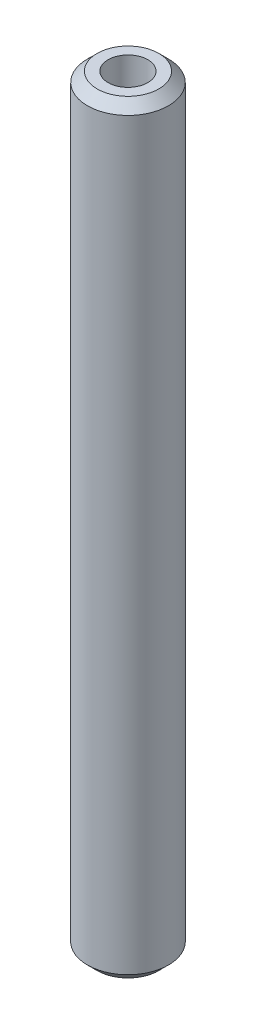
ISO-10303-21;
HEADER;
FILE_DESCRIPTION(('STEP AP214'),'2;1');
FILE_NAME('part.step','',(''),(''),'','','');
FILE_SCHEMA(('AUTOMOTIVE_DESIGN { 1 0 10303 214 1 1 1 1 }'));
ENDSEC;
DATA;
#1=APPLICATION_CONTEXT('core data for automotive mechanical design processes');
#2=APPLICATION_PROTOCOL_DEFINITION('international standard','automotive_design',2000,#1);
#3=PRODUCT_CONTEXT('',#1,'mechanical');
#4=PRODUCT('Part','Part','',(#3));
#5=PRODUCT_RELATED_PRODUCT_CATEGORY('part','',(#4));
#6=PRODUCT_DEFINITION_FORMATION('','',#4);
#7=PRODUCT_DEFINITION_CONTEXT('part definition',#1,'design');
#8=PRODUCT_DEFINITION('design','',#6,#7);
#9=PRODUCT_DEFINITION_SHAPE('','',#8);
#10=(LENGTH_UNIT() NAMED_UNIT(*) SI_UNIT(.MILLI.,.METRE.));
#11=(NAMED_UNIT(*) PLANE_ANGLE_UNIT() SI_UNIT($,.RADIAN.));
#12=(NAMED_UNIT(*) SI_UNIT($,.STERADIAN.) SOLID_ANGLE_UNIT());
#13=UNCERTAINTY_MEASURE_WITH_UNIT(LENGTH_MEASURE(1.E-05),#10,'distance_accuracy_value','');
#14=(GEOMETRIC_REPRESENTATION_CONTEXT(3) GLOBAL_UNCERTAINTY_ASSIGNED_CONTEXT((#13)) GLOBAL_UNIT_ASSIGNED_CONTEXT((#10,
#11,#12)) REPRESENTATION_CONTEXT('',''));
#15=CARTESIAN_POINT('',(0.,0.,0.));
#16=DIRECTION('',(0.,0.,1.));
#17=DIRECTION('',(1.,0.,0.));
#18=AXIS2_PLACEMENT_3D('',#15,#16,#17);
#19=CARTESIAN_POINT('',(0.,94.2059871380384,0.));
#20=DIRECTION('',(0.,-1.,0.));
#21=DIRECTION('',(0.,0.,-1.));
#22=AXIS2_PLACEMENT_3D('',#19,#20,#21);
#23=CYLINDRICAL_SURFACE('',#22,5.);
#24=CARTESIAN_POINT('',(0.,93.0087555606454,0.));
#25=DIRECTION('',(0.,1.,0.));
#26=DIRECTION('',(0.,0.,1.));
#27=AXIS2_PLACEMENT_3D('',#24,#25,#26);
#28=CIRCLE('',#27,5.);
#29=CARTESIAN_POINT('',(0.,93.0087555606454,5.));
#30=VERTEX_POINT('',#29);
#31=EDGE_CURVE('E50',#30,#30,#28,.F.);
#32=ORIENTED_EDGE('',*,*,#31,.T.);
#33=EDGE_LOOP('',(#32));
#34=FACE_BOUND('',#33,.T.);
#35=CARTESIAN_POINT('',(0.,1.197231577393,0.));
#36=DIRECTION('',(0.,1.,0.));
#37=DIRECTION('',(0.,0.,1.));
#38=AXIS2_PLACEMENT_3D('',#35,#36,#37);
#39=CIRCLE('',#38,5.);
#40=CARTESIAN_POINT('',(0.,1.197231577393,5.));
#41=VERTEX_POINT('',#40);
#42=EDGE_CURVE('E51',#41,#41,#39,.T.);
#43=ORIENTED_EDGE('',*,*,#42,.T.);
#44=EDGE_LOOP('',(#43));
#45=FACE_BOUND('',#44,.T.);
#46=ADVANCED_FACE('F39',(#34,#45),#23,.T.);
#47=CARTESIAN_POINT('',(0.,94.2059871380384,0.));
#48=DIRECTION('',(0.,1.,0.));
#49=DIRECTION('',(0.,0.,1.));
#50=AXIS2_PLACEMENT_3D('',#47,#48,#49);
#51=PLANE('',#50);
#52=CARTESIAN_POINT('',(0.,94.2059871380384,0.));
#53=DIRECTION('',(0.,1.,0.));
#54=DIRECTION('',(0.,0.,1.));
#55=AXIS2_PLACEMENT_3D('',#52,#53,#54);
#56=CIRCLE('',#55,3.80276842260699);
#57=CARTESIAN_POINT('',(0.,94.2059871380384,3.80276842260699));
#58=VERTEX_POINT('',#57);
#59=EDGE_CURVE('E54',#58,#58,#56,.T.);
#60=ORIENTED_EDGE('',*,*,#59,.T.);
#61=EDGE_LOOP('',(#60));
#62=FACE_BOUND('',#61,.T.);
#63=CARTESIAN_POINT('',(0.,94.2059871380384,0.));
#64=DIRECTION('',(0.,1.,0.));
#65=DIRECTION('',(0.,0.,1.));
#66=AXIS2_PLACEMENT_3D('',#63,#64,#65);
#67=CIRCLE('',#66,2.45373357901315);
#68=CARTESIAN_POINT('',(0.,94.2059871380384,2.45373357901315));
#69=VERTEX_POINT('',#68);
#70=EDGE_CURVE('E58',#69,#69,#67,.T.);
#71=ORIENTED_EDGE('',*,*,#70,.F.);
#72=EDGE_LOOP('',(#71));
#73=FACE_BOUND('',#72,.T.);
#74=ADVANCED_FACE('F69',(#62,#73),#51,.T.);
#75=CARTESIAN_POINT('',(0.,0.,0.));
#76=DIRECTION('',(0.,1.,0.));
#77=DIRECTION('',(0.,0.,1.));
#78=AXIS2_PLACEMENT_3D('',#75,#76,#77);
#79=PLANE('',#78);
#80=CARTESIAN_POINT('',(0.,0.,0.));
#81=DIRECTION('',(0.,1.,0.));
#82=DIRECTION('',(0.,0.,1.));
#83=AXIS2_PLACEMENT_3D('',#80,#81,#82);
#84=CIRCLE('',#83,3.80276842260698);
#85=CARTESIAN_POINT('',(0.,0.,3.80276842260697));
#86=VERTEX_POINT('',#85);
#87=EDGE_CURVE('E10',#86,#86,#84,.F.);
#88=ORIENTED_EDGE('',*,*,#87,.T.);
#89=EDGE_LOOP('',(#88));
#90=FACE_BOUND('',#89,.T.);
#91=CARTESIAN_POINT('',(0.,0.,0.));
#92=DIRECTION('',(0.,1.,0.));
#93=DIRECTION('',(0.,0.,1.));
#94=AXIS2_PLACEMENT_3D('',#91,#92,#93);
#95=CIRCLE('',#94,2.45373357901315);
#96=CARTESIAN_POINT('',(0.,0.,2.45373357901315));
#97=VERTEX_POINT('',#96);
#98=EDGE_CURVE('E63',#97,#97,#95,.T.);
#99=ORIENTED_EDGE('',*,*,#98,.T.);
#100=EDGE_LOOP('',(#99));
#101=FACE_BOUND('',#100,.T.);
#102=ADVANCED_FACE('F75',(#90,#101),#79,.F.);
#103=CARTESIAN_POINT('',(0.,94.2059871380384,0.));
#104=DIRECTION('',(0.,-1.,0.));
#105=DIRECTION('',(0.,0.,-1.));
#106=AXIS2_PLACEMENT_3D('',#103,#104,#105);
#107=CYLINDRICAL_SURFACE('',#106,2.45373357901315);
#108=ORIENTED_EDGE('',*,*,#70,.T.);
#109=EDGE_LOOP('',(#108));
#110=FACE_BOUND('',#109,.T.);
#111=ORIENTED_EDGE('',*,*,#98,.F.);
#112=EDGE_LOOP('',(#111));
#113=FACE_BOUND('',#112,.T.);
#114=ADVANCED_FACE('F70',(#110,#113),#107,.F.);
#115=CARTESIAN_POINT('',(0.,94.2059871380384,0.));
#116=DIRECTION('',(0.,-1.,0.));
#117=DIRECTION('',(0.,0.,-1.));
#118=AXIS2_PLACEMENT_3D('',#115,#116,#117);
#119=CONICAL_SURFACE('',#118,3.80276842260699,0.785398163397447);
#120=ORIENTED_EDGE('',*,*,#31,.F.);
#121=EDGE_LOOP('',(#120));
#122=FACE_BOUND('',#121,.T.);
#123=ORIENTED_EDGE('',*,*,#59,.F.);
#124=EDGE_LOOP('',(#123));
#125=FACE_BOUND('',#124,.T.);
#126=ADVANCED_FACE('F81',(#122,#125),#119,.T.);
#127=CARTESIAN_POINT('',(0.,1.197231577393,0.));
#128=DIRECTION('',(0.,1.,0.));
#129=DIRECTION('',(0.,0.,1.));
#130=AXIS2_PLACEMENT_3D('',#127,#128,#129);
#131=CONICAL_SURFACE('',#130,5.,0.785398163397458);
#132=CARTESIAN_POINT('',(0.,0.,3.80276842260697));
#133=CARTESIAN_POINT('',(0.,0.0124711622645101,3.81523958487149));
#134=CARTESIAN_POINT('',(0.,0.0249423245290205,3.827710747136));
#135=CARTESIAN_POINT('',(0.,0.0498846490580415,3.85265307166502));
#136=CARTESIAN_POINT('',(0.,0.062355811322552,3.86512423392953));
#137=CARTESIAN_POINT('',(0.,0.0872981358515729,3.89006655845855));
#138=CARTESIAN_POINT('',(0.,0.0997692981160832,3.90253772072306));
#139=CARTESIAN_POINT('',(0.,0.124711622645104,3.92748004525208));
#140=CARTESIAN_POINT('',(0.,0.137182784909614,3.93995120751659));
#141=CARTESIAN_POINT('',(0.,0.162125109438635,3.96489353204561));
#142=CARTESIAN_POINT('',(0.,0.174596271703146,3.97736469431012));
#143=CARTESIAN_POINT('',(0.,0.199538596232167,4.00230701883915));
#144=CARTESIAN_POINT('',(0.,0.212009758496677,4.01477818110366));
#145=CARTESIAN_POINT('',(0.,0.236952083025698,4.03972050563268));
#146=CARTESIAN_POINT('',(0.,0.249423245290208,4.05219166789719));
#147=CARTESIAN_POINT('',(0.,0.274365569819229,4.07713399242621));
#148=CARTESIAN_POINT('',(0.,0.28683673208374,4.08960515469072));
#149=CARTESIAN_POINT('',(0.,0.311779056612761,4.11454747921974));
#150=CARTESIAN_POINT('',(0.,0.324250218877271,4.12701864148425));
#151=CARTESIAN_POINT('',(0.,0.349192543406292,4.15196096601327));
#152=CARTESIAN_POINT('',(0.,0.361663705670802,4.16443212827778));
#153=CARTESIAN_POINT('',(0.,0.386606030199823,4.18937445280681));
#154=CARTESIAN_POINT('',(0.,0.399077192464334,4.20184561507132));
#155=CARTESIAN_POINT('',(0.,0.424019516993355,4.22678793960034));
#156=CARTESIAN_POINT('',(0.,0.436490679257865,4.23925910186485));
#157=CARTESIAN_POINT('',(0.,0.461433003786886,4.26420142639387));
#158=CARTESIAN_POINT('',(0.,0.473904166051396,4.27667258865838));
#159=CARTESIAN_POINT('',(0.,0.498846490580417,4.3016149131874));
#160=CARTESIAN_POINT('',(0.,0.511317652844928,4.31408607545191));
#161=CARTESIAN_POINT('',(0.,0.536259977373948,4.33902839998093));
#162=CARTESIAN_POINT('',(0.,0.548731139638459,4.35149956224544));
#163=CARTESIAN_POINT('',(0.,0.57367346416748,4.37644188677447));
#164=CARTESIAN_POINT('',(0.,0.58614462643199,4.38891304903898));
#165=CARTESIAN_POINT('',(0.,0.611086950961011,4.413855373568));
#166=CARTESIAN_POINT('',(0.,0.623558113225521,4.42632653583251));
#167=CARTESIAN_POINT('',(0.,0.648500437754542,4.45126886036153));
#168=CARTESIAN_POINT('',(0.,0.660971600019053,4.46374002262604));
#169=CARTESIAN_POINT('',(0.,0.685913924548074,4.48868234715506));
#170=CARTESIAN_POINT('',(0.,0.698385086812584,4.50115350941957));
#171=CARTESIAN_POINT('',(0.,0.723327411341605,4.52609583394859));
#172=CARTESIAN_POINT('',(0.,0.735798573606115,4.53856699621311));
#173=CARTESIAN_POINT('',(0.,0.760740898135136,4.56350932074213));
#174=CARTESIAN_POINT('',(0.,0.773212060399647,4.57598048300664));
#175=CARTESIAN_POINT('',(0.,0.798154384928668,4.60092280753566));
#176=CARTESIAN_POINT('',(0.,0.810625547193178,4.61339396980017));
#177=CARTESIAN_POINT('',(0.,0.835567871722199,4.63833629432919));
#178=CARTESIAN_POINT('',(0.,0.848039033986709,4.6508074565937));
#179=CARTESIAN_POINT('',(0.,0.87298135851573,4.67574978112272));
#180=CARTESIAN_POINT('',(0.,0.885452520780241,4.68822094338723));
#181=CARTESIAN_POINT('',(0.,0.910394845309262,4.71316326791625));
#182=CARTESIAN_POINT('',(0.,0.922866007573772,4.72563443018077));
#183=CARTESIAN_POINT('',(0.,0.947808332102793,4.75057675470979));
#184=CARTESIAN_POINT('',(0.,0.960279494367303,4.7630479169743));
#185=CARTESIAN_POINT('',(0.,0.985221818896324,4.78799024150332));
#186=CARTESIAN_POINT('',(0.,0.997692981160835,4.80046140376783));
#187=CARTESIAN_POINT('',(0.,1.02263530568986,4.82540372829685));
#188=CARTESIAN_POINT('',(0.,1.03510646795437,4.83787489056136));
#189=CARTESIAN_POINT('',(0.,1.06004879248339,4.86281721509038));
#190=CARTESIAN_POINT('',(0.,1.0725199547479,4.87528837735489));
#191=CARTESIAN_POINT('',(0.,1.09746227927692,4.90023070188392));
#192=CARTESIAN_POINT('',(0.,1.10993344154143,4.91270186414843));
#193=CARTESIAN_POINT('',(0.,1.13487576607045,4.93764418867745));
#194=CARTESIAN_POINT('',(0.,1.14734692833496,4.95011535094196));
#195=CARTESIAN_POINT('',(0.,1.17228925286398,4.97505767547098));
#196=CARTESIAN_POINT('',(0.,1.18476041512849,4.98752883773549));
#197=CARTESIAN_POINT('',(0.,1.197231577393,5.));
#198=B_SPLINE_CURVE_WITH_KNOTS('',3,(#132,#133,#134,#135,#136,#137,#138,#139,#140,#141,#142,
#143,#144,#145,#146,#147,#148,#149,#150,#151,#152,#153,#154,#155,#156,#157,#158,#159,#160,#161,
#162,#163,#164,#165,#166,#167,#168,#169,#170,#171,#172,#173,#174,#175,#176,#177,#178,#179,#180,
#181,#182,#183,#184,#185,#186,#187,#188,#189,#190,#191,#192,#193,#194,#195,#196,#197),
.UNSPECIFIED.,.F.,.F.,(4,2,2,2,2,2,2,2,2,2,2,2,2,2,2,2,2,2,2,2,2,2,2,2,2,2,2,2,2,2,2,2,4),(0.,
0.0529106604390793,0.105821320878158,0.158731981317238,0.211642641756317,0.264553302195396,
0.317463962634475,0.370374623073554,0.423285283512633,0.476195943951713,0.529106604390792,
0.582017264829871,0.63492792526895,0.687838585708029,0.740749246147109,0.793659906586188,
0.846570567025267,0.899481227464346,0.952391887903425,1.0053025483425,1.05821320878158,
1.11112386922066,1.16403452965974,1.21694519009882,1.2698558505379,1.32276651097698,
1.37567717141606,1.42858783185514,1.48149849229422,1.5344091527333,1.58731981317238,
1.64023047361145,1.69314113405053),.UNSPECIFIED.);
#199=EDGE_CURVE('BSEAM45',#86,#41,#198,.T.);
#200=ORIENTED_EDGE('',*,*,#87,.F.);
#201=ORIENTED_EDGE('',*,*,#42,.F.);
#202=ORIENTED_EDGE('',*,*,#199,.T.);
#203=ORIENTED_EDGE('',*,*,#199,.F.);
#204=EDGE_LOOP('',(#200,#202,#201,#203));
#205=FACE_BOUND('',#204,.T.);
#206=ADVANCED_FACE('F45',(#205),#131,.T.);
#207=CLOSED_SHELL('',(#46,#74,#102,#114,#126,#206));
#208=MANIFOLD_SOLID_BREP('B2',#207);
#209=ADVANCED_BREP_SHAPE_REPRESENTATION('',(#18,#208),#14);
#210=SHAPE_DEFINITION_REPRESENTATION(#9,#209);
ENDSEC;
END-ISO-10303-21;
